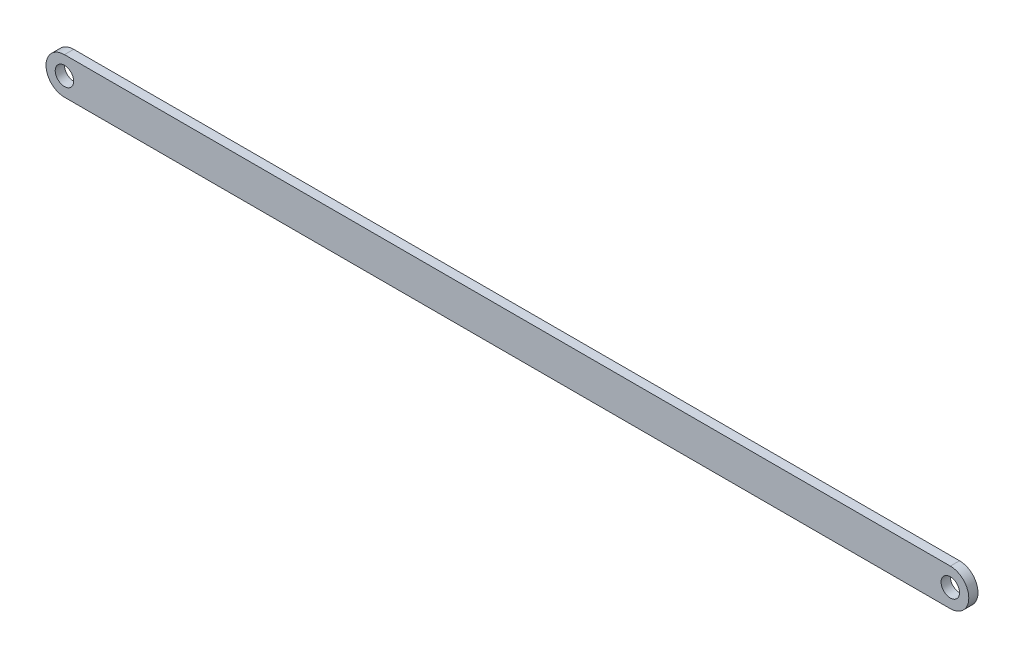
ISO-10303-21;
HEADER;
FILE_DESCRIPTION(('STEP AP214'),'2;1');
FILE_NAME('part.step','',(''),(''),'','','');
FILE_SCHEMA(('AUTOMOTIVE_DESIGN { 1 0 10303 214 1 1 1 1 }'));
ENDSEC;
DATA;
#1=APPLICATION_CONTEXT('core data for automotive mechanical design processes');
#2=APPLICATION_PROTOCOL_DEFINITION('international standard','automotive_design',2000,#1);
#3=PRODUCT_CONTEXT('',#1,'mechanical');
#4=PRODUCT('Part','Part','',(#3));
#5=PRODUCT_RELATED_PRODUCT_CATEGORY('part','',(#4));
#6=PRODUCT_DEFINITION_FORMATION('','',#4);
#7=PRODUCT_DEFINITION_CONTEXT('part definition',#1,'design');
#8=PRODUCT_DEFINITION('design','',#6,#7);
#9=PRODUCT_DEFINITION_SHAPE('','',#8);
#10=(LENGTH_UNIT() NAMED_UNIT(*) SI_UNIT(.MILLI.,.METRE.));
#11=(NAMED_UNIT(*) PLANE_ANGLE_UNIT() SI_UNIT($,.RADIAN.));
#12=(NAMED_UNIT(*) SI_UNIT($,.STERADIAN.) SOLID_ANGLE_UNIT());
#13=UNCERTAINTY_MEASURE_WITH_UNIT(LENGTH_MEASURE(1.E-05),#10,'distance_accuracy_value','');
#14=(GEOMETRIC_REPRESENTATION_CONTEXT(3) GLOBAL_UNCERTAINTY_ASSIGNED_CONTEXT((#13)) GLOBAL_UNIT_ASSIGNED_CONTEXT((#10,
#11,#12)) REPRESENTATION_CONTEXT('',''));
#15=CARTESIAN_POINT('',(0.,0.,0.));
#16=DIRECTION('',(0.,0.,1.));
#17=DIRECTION('',(1.,0.,0.));
#18=AXIS2_PLACEMENT_3D('',#15,#16,#17);
#19=CARTESIAN_POINT('',(-152.4,0.,3.175));
#20=DIRECTION('',(0.,0.,1.));
#21=DIRECTION('',(1.,0.,0.));
#22=AXIS2_PLACEMENT_3D('',#19,#20,#21);
#23=PLANE('',#22);
#24=CARTESIAN_POINT('',(-152.4,0.,3.175));
#25=DIRECTION('',(0.,0.,1.));
#26=DIRECTION('',(1.,0.,0.));
#27=AXIS2_PLACEMENT_3D('',#24,#25,#26);
#28=CIRCLE('',#27,3.175);
#29=CARTESIAN_POINT('',(-149.225,0.,3.175));
#30=VERTEX_POINT('',#29);
#31=EDGE_CURVE('E129',#30,#30,#28,.T.);
#32=ORIENTED_EDGE('',*,*,#31,.F.);
#33=EDGE_LOOP('',(#32));
#34=FACE_BOUND('',#33,.T.);
#35=CARTESIAN_POINT('',(-152.4,0.,3.175));
#36=DIRECTION('',(0.,0.,1.));
#37=DIRECTION('',(1.,0.,0.));
#38=AXIS2_PLACEMENT_3D('',#35,#36,#37);
#39=CIRCLE('',#38,6.35);
#40=CARTESIAN_POINT('',(-152.4,6.34999999999999,3.175));
#41=VERTEX_POINT('',#40);
#42=CARTESIAN_POINT('',(-152.4,-6.35000000000001,3.175));
#43=VERTEX_POINT('',#42);
#44=EDGE_CURVE('E113',#41,#43,#39,.T.);
#45=ORIENTED_EDGE('',*,*,#44,.T.);
#46=DIRECTION('',(1.,0.,0.));
#47=VECTOR('',#46,1.);
#48=CARTESIAN_POINT('',(-152.4,-6.35000000000001,3.175));
#49=LINE('',#48,#47);
#50=CARTESIAN_POINT('',(152.4,-6.35000000000001,3.175));
#51=VERTEX_POINT('',#50);
#52=EDGE_CURVE('E106',#43,#51,#49,.T.);
#53=ORIENTED_EDGE('',*,*,#52,.T.);
#54=CARTESIAN_POINT('',(152.4,0.,3.175));
#55=DIRECTION('',(0.,0.,1.));
#56=DIRECTION('',(1.,0.,0.));
#57=AXIS2_PLACEMENT_3D('',#54,#55,#56);
#58=CIRCLE('',#57,6.35);
#59=CARTESIAN_POINT('',(152.4,6.34999999999999,3.175));
#60=VERTEX_POINT('',#59);
#61=EDGE_CURVE('E112',#51,#60,#58,.T.);
#62=ORIENTED_EDGE('',*,*,#61,.T.);
#63=DIRECTION('',(1.,0.,0.));
#64=VECTOR('',#63,1.);
#65=CARTESIAN_POINT('',(-152.4,6.34999999999999,3.175));
#66=LINE('',#65,#64);
#67=EDGE_CURVE('E122',#41,#60,#66,.T.);
#68=ORIENTED_EDGE('',*,*,#67,.F.);
#69=EDGE_LOOP('',(#45,#53,#62,#68));
#70=FACE_BOUND('',#69,.T.);
#71=CARTESIAN_POINT('',(152.4,0.,3.175));
#72=DIRECTION('',(0.,0.,1.));
#73=DIRECTION('',(1.,0.,0.));
#74=AXIS2_PLACEMENT_3D('',#71,#72,#73);
#75=CIRCLE('',#74,3.175);
#76=CARTESIAN_POINT('',(155.575,0.,3.175));
#77=VERTEX_POINT('',#76);
#78=EDGE_CURVE('E142',#77,#77,#75,.T.);
#79=ORIENTED_EDGE('',*,*,#78,.F.);
#80=EDGE_LOOP('',(#79));
#81=FACE_BOUND('',#80,.T.);
#82=ADVANCED_FACE('F63',(#34,#70,#81),#23,.T.);
#83=CARTESIAN_POINT('',(-152.4,0.,0.));
#84=DIRECTION('',(0.,0.,1.));
#85=DIRECTION('',(1.,0.,0.));
#86=AXIS2_PLACEMENT_3D('',#83,#84,#85);
#87=PLANE('',#86);
#88=CARTESIAN_POINT('',(-152.4,0.,0.));
#89=DIRECTION('',(0.,0.,1.));
#90=DIRECTION('',(1.,0.,0.));
#91=AXIS2_PLACEMENT_3D('',#88,#89,#90);
#92=CIRCLE('',#91,6.35);
#93=CARTESIAN_POINT('',(-152.4,6.34999999999999,0.));
#94=VERTEX_POINT('',#93);
#95=CARTESIAN_POINT('',(-152.4,-6.35000000000001,0.));
#96=VERTEX_POINT('',#95);
#97=EDGE_CURVE('E127',#94,#96,#92,.T.);
#98=ORIENTED_EDGE('',*,*,#97,.F.);
#99=DIRECTION('',(1.,0.,0.));
#100=VECTOR('',#99,1.);
#101=CARTESIAN_POINT('',(-152.4,6.34999999999999,0.));
#102=LINE('',#101,#100);
#103=CARTESIAN_POINT('',(152.4,6.34999999999999,0.));
#104=VERTEX_POINT('',#103);
#105=EDGE_CURVE('E133',#94,#104,#102,.T.);
#106=ORIENTED_EDGE('',*,*,#105,.T.);
#107=CARTESIAN_POINT('',(152.4,0.,0.));
#108=DIRECTION('',(0.,0.,1.));
#109=DIRECTION('',(1.,0.,0.));
#110=AXIS2_PLACEMENT_3D('',#107,#108,#109);
#111=CIRCLE('',#110,6.35);
#112=CARTESIAN_POINT('',(152.4,-6.35000000000001,0.));
#113=VERTEX_POINT('',#112);
#114=EDGE_CURVE('E131',#113,#104,#111,.T.);
#115=ORIENTED_EDGE('',*,*,#114,.F.);
#116=DIRECTION('',(1.,0.,0.));
#117=VECTOR('',#116,1.);
#118=CARTESIAN_POINT('',(-152.4,-6.35000000000001,0.));
#119=LINE('',#118,#117);
#120=EDGE_CURVE('E118',#96,#113,#119,.T.);
#121=ORIENTED_EDGE('',*,*,#120,.F.);
#122=EDGE_LOOP('',(#98,#106,#115,#121));
#123=FACE_BOUND('',#122,.T.);
#124=CARTESIAN_POINT('',(-152.4,0.,0.));
#125=DIRECTION('',(0.,0.,1.));
#126=DIRECTION('',(1.,0.,0.));
#127=AXIS2_PLACEMENT_3D('',#124,#125,#126);
#128=CIRCLE('',#127,3.175);
#129=CARTESIAN_POINT('',(-149.225,0.,0.));
#130=VERTEX_POINT('',#129);
#131=EDGE_CURVE('E139',#130,#130,#128,.T.);
#132=ORIENTED_EDGE('',*,*,#131,.T.);
#133=EDGE_LOOP('',(#132));
#134=FACE_BOUND('',#133,.T.);
#135=CARTESIAN_POINT('',(152.4,0.,0.));
#136=DIRECTION('',(0.,0.,1.));
#137=DIRECTION('',(1.,0.,0.));
#138=AXIS2_PLACEMENT_3D('',#135,#136,#137);
#139=CIRCLE('',#138,3.175);
#140=CARTESIAN_POINT('',(155.575,0.,0.));
#141=VERTEX_POINT('',#140);
#142=EDGE_CURVE('E145',#141,#141,#139,.T.);
#143=ORIENTED_EDGE('',*,*,#142,.T.);
#144=EDGE_LOOP('',(#143));
#145=FACE_BOUND('',#144,.T.);
#146=ADVANCED_FACE('F154',(#123,#134,#145),#87,.F.);
#147=CARTESIAN_POINT('',(-152.4,0.,3.175));
#148=DIRECTION('',(0.,0.,-1.));
#149=DIRECTION('',(-1.,0.,0.));
#150=AXIS2_PLACEMENT_3D('',#147,#148,#149);
#151=CYLINDRICAL_SURFACE('',#150,6.35);
#152=ORIENTED_EDGE('',*,*,#97,.T.);
#153=DIRECTION('',(0.,0.,-1.));
#154=VECTOR('',#153,1.);
#155=CARTESIAN_POINT('',(-152.4,-6.35000000000001,3.175));
#156=LINE('',#155,#154);
#157=EDGE_CURVE('E12',#43,#96,#156,.T.);
#158=ORIENTED_EDGE('',*,*,#157,.F.);
#159=ORIENTED_EDGE('',*,*,#44,.F.);
#160=DIRECTION('',(0.,0.,-1.));
#161=VECTOR('',#160,1.);
#162=CARTESIAN_POINT('',(-152.4,6.34999999999999,3.175));
#163=LINE('',#162,#161);
#164=EDGE_CURVE('E80',#41,#94,#163,.T.);
#165=ORIENTED_EDGE('',*,*,#164,.T.);
#166=EDGE_LOOP('',(#152,#158,#159,#165));
#167=FACE_BOUND('',#166,.T.);
#168=ADVANCED_FACE('F65',(#167),#151,.T.);
#169=CARTESIAN_POINT('',(-152.4,-6.35000000000001,3.175));
#170=DIRECTION('',(0.,1.,0.));
#171=DIRECTION('',(0.,0.,1.));
#172=AXIS2_PLACEMENT_3D('',#169,#170,#171);
#173=PLANE('',#172);
#174=ORIENTED_EDGE('',*,*,#120,.T.);
#175=DIRECTION('',(0.,0.,-1.));
#176=VECTOR('',#175,1.);
#177=CARTESIAN_POINT('',(152.4,-6.35000000000001,3.175));
#178=LINE('',#177,#176);
#179=EDGE_CURVE('E72',#51,#113,#178,.T.);
#180=ORIENTED_EDGE('',*,*,#179,.F.);
#181=ORIENTED_EDGE('',*,*,#52,.F.);
#182=ORIENTED_EDGE('',*,*,#157,.T.);
#183=EDGE_LOOP('',(#174,#180,#181,#182));
#184=FACE_BOUND('',#183,.T.);
#185=ADVANCED_FACE('F117',(#184),#173,.F.);
#186=CARTESIAN_POINT('',(152.4,0.,3.175));
#187=DIRECTION('',(0.,0.,-1.));
#188=DIRECTION('',(-1.,0.,0.));
#189=AXIS2_PLACEMENT_3D('',#186,#187,#188);
#190=CYLINDRICAL_SURFACE('',#189,6.35);
#191=ORIENTED_EDGE('',*,*,#114,.T.);
#192=DIRECTION('',(0.,0.,-1.));
#193=VECTOR('',#192,1.);
#194=CARTESIAN_POINT('',(152.4,6.34999999999999,3.175));
#195=LINE('',#194,#193);
#196=EDGE_CURVE('E95',#60,#104,#195,.T.);
#197=ORIENTED_EDGE('',*,*,#196,.F.);
#198=ORIENTED_EDGE('',*,*,#61,.F.);
#199=ORIENTED_EDGE('',*,*,#179,.T.);
#200=EDGE_LOOP('',(#191,#197,#198,#199));
#201=FACE_BOUND('',#200,.T.);
#202=ADVANCED_FACE('F121',(#201),#190,.T.);
#203=CARTESIAN_POINT('',(-152.4,6.34999999999999,3.175));
#204=DIRECTION('',(0.,1.,0.));
#205=DIRECTION('',(0.,0.,1.));
#206=AXIS2_PLACEMENT_3D('',#203,#204,#205);
#207=PLANE('',#206);
#208=ORIENTED_EDGE('',*,*,#105,.F.);
#209=ORIENTED_EDGE('',*,*,#164,.F.);
#210=ORIENTED_EDGE('',*,*,#67,.T.);
#211=ORIENTED_EDGE('',*,*,#196,.T.);
#212=EDGE_LOOP('',(#208,#209,#210,#211));
#213=FACE_BOUND('',#212,.T.);
#214=ADVANCED_FACE('F166',(#213),#207,.T.);
#215=CARTESIAN_POINT('',(-152.4,0.,3.175));
#216=DIRECTION('',(0.,0.,-1.));
#217=DIRECTION('',(-1.,0.,0.));
#218=AXIS2_PLACEMENT_3D('',#215,#216,#217);
#219=CYLINDRICAL_SURFACE('',#218,3.175);
#220=ORIENTED_EDGE('',*,*,#31,.T.);
#221=EDGE_LOOP('',(#220));
#222=FACE_BOUND('',#221,.T.);
#223=ORIENTED_EDGE('',*,*,#131,.F.);
#224=EDGE_LOOP('',(#223));
#225=FACE_BOUND('',#224,.T.);
#226=ADVANCED_FACE('F163',(#222,#225),#219,.F.);
#227=CARTESIAN_POINT('',(152.4,0.,3.175));
#228=DIRECTION('',(0.,0.,-1.));
#229=DIRECTION('',(-1.,0.,0.));
#230=AXIS2_PLACEMENT_3D('',#227,#228,#229);
#231=CYLINDRICAL_SURFACE('',#230,3.175);
#232=ORIENTED_EDGE('',*,*,#78,.T.);
#233=EDGE_LOOP('',(#232));
#234=FACE_BOUND('',#233,.T.);
#235=ORIENTED_EDGE('',*,*,#142,.F.);
#236=EDGE_LOOP('',(#235));
#237=FACE_BOUND('',#236,.T.);
#238=ADVANCED_FACE('F151',(#234,#237),#231,.F.);
#239=CLOSED_SHELL('',(#82,#146,#168,#185,#202,#214,#226,#238));
#240=MANIFOLD_SOLID_BREP('B2',#239);
#241=ADVANCED_BREP_SHAPE_REPRESENTATION('',(#18,#240),#14);
#242=SHAPE_DEFINITION_REPRESENTATION(#9,#241);
ENDSEC;
END-ISO-10303-21;
